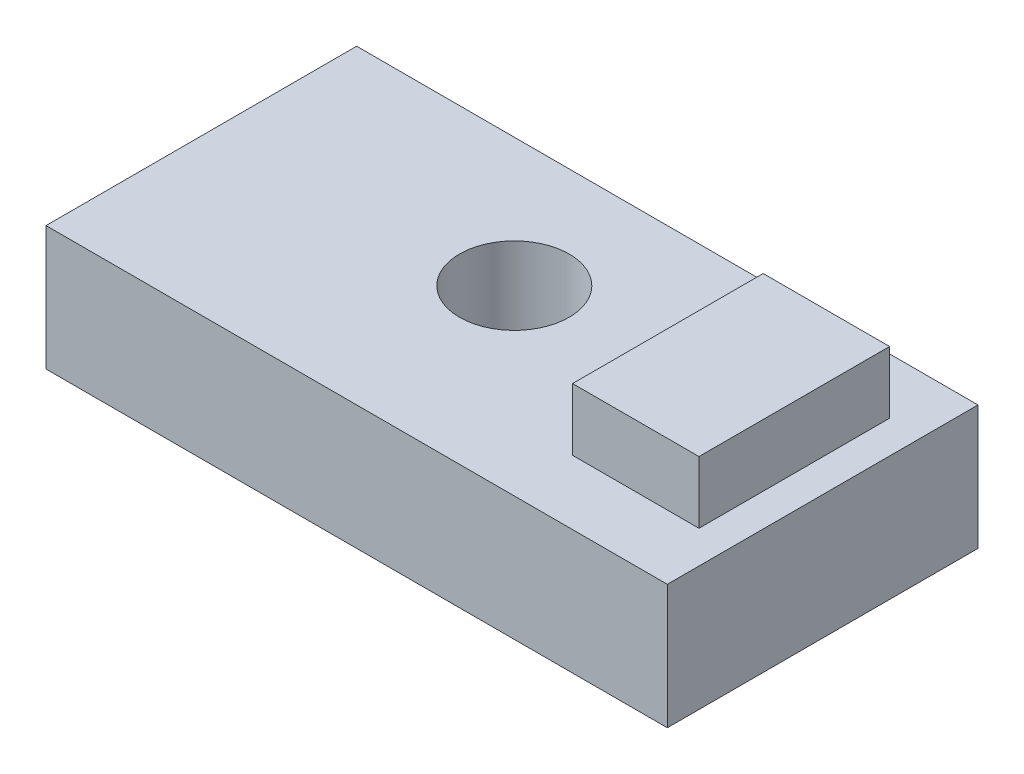
ISO-10303-21;
HEADER;
FILE_DESCRIPTION(('STEP AP214'),'2;1');
FILE_NAME('part.step','',(''),(''),'','','');
FILE_SCHEMA(('AUTOMOTIVE_DESIGN { 1 0 10303 214 1 1 1 1 }'));
ENDSEC;
DATA;
#1=APPLICATION_CONTEXT('core data for automotive mechanical design processes');
#2=APPLICATION_PROTOCOL_DEFINITION('international standard','automotive_design',2000,#1);
#3=PRODUCT_CONTEXT('',#1,'mechanical');
#4=PRODUCT('Part','Part','',(#3));
#5=PRODUCT_RELATED_PRODUCT_CATEGORY('part','',(#4));
#6=PRODUCT_DEFINITION_FORMATION('','',#4);
#7=PRODUCT_DEFINITION_CONTEXT('part definition',#1,'design');
#8=PRODUCT_DEFINITION('design','',#6,#7);
#9=PRODUCT_DEFINITION_SHAPE('','',#8);
#10=(LENGTH_UNIT() NAMED_UNIT(*) SI_UNIT(.MILLI.,.METRE.));
#11=(NAMED_UNIT(*) PLANE_ANGLE_UNIT() SI_UNIT($,.RADIAN.));
#12=(NAMED_UNIT(*) SI_UNIT($,.STERADIAN.) SOLID_ANGLE_UNIT());
#13=UNCERTAINTY_MEASURE_WITH_UNIT(LENGTH_MEASURE(1.E-05),#10,'distance_accuracy_value','');
#14=(GEOMETRIC_REPRESENTATION_CONTEXT(3) GLOBAL_UNCERTAINTY_ASSIGNED_CONTEXT((#13)) GLOBAL_UNIT_ASSIGNED_CONTEXT((#10,
#11,#12)) REPRESENTATION_CONTEXT('',''));
#15=CARTESIAN_POINT('',(0.,0.,0.));
#16=DIRECTION('',(0.,0.,1.));
#17=DIRECTION('',(1.,0.,0.));
#18=AXIS2_PLACEMENT_3D('',#15,#16,#17);
#19=CARTESIAN_POINT('',(0.,762.,0.));
#20=DIRECTION('',(0.,-1.,0.));
#21=DIRECTION('',(0.,0.,-1.));
#22=AXIS2_PLACEMENT_3D('',#19,#20,#21);
#23=PLANE('',#22);
#24=DIRECTION('',(1.,0.,0.));
#25=VECTOR('',#24,1.);
#26=CARTESIAN_POINT('',(-342.373271889401,762.,776.923963133641));
#27=LINE('',#26,#25);
#28=CARTESIAN_POINT('',(-342.373271889401,762.,776.923963133641));
#29=VERTEX_POINT('',#28);
#30=CARTESIAN_POINT('',(3467.6267281106,762.,776.923963133641));
#31=VERTEX_POINT('',#30);
#32=EDGE_CURVE('E145',#29,#31,#27,.T.);
#33=ORIENTED_EDGE('',*,*,#32,.T.);
#34=DIRECTION('',(0.,0.,1.));
#35=VECTOR('',#34,1.);
#36=CARTESIAN_POINT('',(3467.6267281106,762.,-1128.07603686636));
#37=LINE('',#36,#35);
#38=CARTESIAN_POINT('',(3467.6267281106,762.,-1128.07603686636));
#39=VERTEX_POINT('',#38);
#40=EDGE_CURVE('E148',#39,#31,#37,.T.);
#41=ORIENTED_EDGE('',*,*,#40,.F.);
#42=DIRECTION('',(1.,0.,0.));
#43=VECTOR('',#42,1.);
#44=CARTESIAN_POINT('',(-342.373271889401,762.,-1128.07603686636));
#45=LINE('',#44,#43);
#46=CARTESIAN_POINT('',(-342.373271889401,762.,-1128.07603686636));
#47=VERTEX_POINT('',#46);
#48=EDGE_CURVE('E153',#47,#39,#45,.T.);
#49=ORIENTED_EDGE('',*,*,#48,.F.);
#50=DIRECTION('',(0.,0.,1.));
#51=VECTOR('',#50,1.);
#52=CARTESIAN_POINT('',(-342.373271889401,762.,-1128.07603686636));
#53=LINE('',#52,#51);
#54=EDGE_CURVE('E157',#47,#29,#53,.T.);
#55=ORIENTED_EDGE('',*,*,#54,.T.);
#56=EDGE_LOOP('',(#33,#41,#49,#55));
#57=FACE_BOUND('',#56,.T.);
#58=CARTESIAN_POINT('',(1412.46673219988,762.,-339.940416014676));
#59=DIRECTION('',(0.,1.,0.));
#60=DIRECTION('',(0.,0.,1.));
#61=AXIS2_PLACEMENT_3D('',#58,#59,#60);
#62=CIRCLE('',#61,336.258211587935);
#63=CARTESIAN_POINT('',(1412.46673219988,762.,-3.68220442674011));
#64=VERTEX_POINT('',#63);
#65=EDGE_CURVE('E130',#64,#64,#62,.T.);
#66=ORIENTED_EDGE('',*,*,#65,.F.);
#67=EDGE_LOOP('',(#66));
#68=FACE_BOUND('',#67,.T.);
#69=DIRECTION('',(0.,0.,1.));
#70=VECTOR('',#69,1.);
#71=CARTESIAN_POINT('',(2491.99555228911,762.,-786.362098171456));
#72=LINE('',#71,#70);
#73=CARTESIAN_POINT('',(2491.99555228911,762.,-786.362098171456));
#74=VERTEX_POINT('',#73);
#75=CARTESIAN_POINT('',(2491.99555228911,762.,382.451095555233));
#76=VERTEX_POINT('',#75);
#77=EDGE_CURVE('E128',#74,#76,#72,.T.);
#78=ORIENTED_EDGE('',*,*,#77,.F.);
#79=DIRECTION('',(-1.,0.,0.));
#80=VECTOR('',#79,1.);
#81=CARTESIAN_POINT('',(2491.99555228911,762.,-786.362098171456));
#82=LINE('',#81,#80);
#83=CARTESIAN_POINT('',(3267.14596896202,762.,-786.362098171456));
#84=VERTEX_POINT('',#83);
#85=EDGE_CURVE('E125',#84,#74,#82,.T.);
#86=ORIENTED_EDGE('',*,*,#85,.F.);
#87=DIRECTION('',(0.,0.,-1.));
#88=VECTOR('',#87,1.);
#89=CARTESIAN_POINT('',(3267.14596896202,762.,-786.362098171456));
#90=LINE('',#89,#88);
#91=CARTESIAN_POINT('',(3267.14596896202,762.,382.451095555233));
#92=VERTEX_POINT('',#91);
#93=EDGE_CURVE('E62',#92,#84,#90,.T.);
#94=ORIENTED_EDGE('',*,*,#93,.F.);
#95=DIRECTION('',(1.,0.,0.));
#96=VECTOR('',#95,1.);
#97=CARTESIAN_POINT('',(2491.99555228911,762.,382.451095555233));
#98=LINE('',#97,#96);
#99=EDGE_CURVE('E57',#76,#92,#98,.T.);
#100=ORIENTED_EDGE('',*,*,#99,.F.);
#101=EDGE_LOOP('',(#78,#86,#94,#100));
#102=FACE_BOUND('',#101,.T.);
#103=ADVANCED_FACE('F41',(#57,#68,#102),#23,.F.);
#104=CARTESIAN_POINT('',(-342.373271889401,762.,776.923963133641));
#105=DIRECTION('',(0.,0.,-1.));
#106=DIRECTION('',(-1.,0.,0.));
#107=AXIS2_PLACEMENT_3D('',#104,#105,#106);
#108=PLANE('',#107);
#109=DIRECTION('',(1.,0.,0.));
#110=VECTOR('',#109,1.);
#111=CARTESIAN_POINT('',(-342.373271889401,0.,776.923963133641));
#112=LINE('',#111,#110);
#113=CARTESIAN_POINT('',(-342.373271889401,0.,776.923963133641));
#114=VERTEX_POINT('',#113);
#115=CARTESIAN_POINT('',(3467.6267281106,0.,776.923963133641));
#116=VERTEX_POINT('',#115);
#117=EDGE_CURVE('E143',#114,#116,#112,.T.);
#118=ORIENTED_EDGE('',*,*,#117,.T.);
#119=DIRECTION('',(0.,-1.,0.));
#120=VECTOR('',#119,1.);
#121=CARTESIAN_POINT('',(3467.6267281106,762.,776.923963133641));
#122=LINE('',#121,#120);
#123=EDGE_CURVE('E11',#31,#116,#122,.T.);
#124=ORIENTED_EDGE('',*,*,#123,.F.);
#125=ORIENTED_EDGE('',*,*,#32,.F.);
#126=DIRECTION('',(0.,-1.,0.));
#127=VECTOR('',#126,1.);
#128=CARTESIAN_POINT('',(-342.373271889401,762.,776.923963133641));
#129=LINE('',#128,#127);
#130=EDGE_CURVE('E160',#29,#114,#129,.T.);
#131=ORIENTED_EDGE('',*,*,#130,.T.);
#132=EDGE_LOOP('',(#118,#124,#125,#131));
#133=FACE_BOUND('',#132,.T.);
#134=ADVANCED_FACE('F43',(#133),#108,.F.);
#135=CARTESIAN_POINT('',(3467.6267281106,762.,-1128.07603686636));
#136=DIRECTION('',(1.,0.,0.));
#137=DIRECTION('',(0.,0.,-1.));
#138=AXIS2_PLACEMENT_3D('',#135,#136,#137);
#139=PLANE('',#138);
#140=DIRECTION('',(0.,0.,1.));
#141=VECTOR('',#140,1.);
#142=CARTESIAN_POINT('',(3467.6267281106,0.,-1128.07603686636));
#143=LINE('',#142,#141);
#144=CARTESIAN_POINT('',(3467.6267281106,0.,-1128.07603686636));
#145=VERTEX_POINT('',#144);
#146=EDGE_CURVE('E164',#145,#116,#143,.T.);
#147=ORIENTED_EDGE('',*,*,#146,.F.);
#148=DIRECTION('',(0.,-1.,0.));
#149=VECTOR('',#148,1.);
#150=CARTESIAN_POINT('',(3467.6267281106,762.,-1128.07603686636));
#151=LINE('',#150,#149);
#152=EDGE_CURVE('E50',#39,#145,#151,.T.);
#153=ORIENTED_EDGE('',*,*,#152,.F.);
#154=ORIENTED_EDGE('',*,*,#40,.T.);
#155=ORIENTED_EDGE('',*,*,#123,.T.);
#156=EDGE_LOOP('',(#147,#153,#154,#155));
#157=FACE_BOUND('',#156,.T.);
#158=ADVANCED_FACE('F187',(#157),#139,.T.);
#159=CARTESIAN_POINT('',(-342.373271889401,762.,-1128.07603686636));
#160=DIRECTION('',(0.,0.,-1.));
#161=DIRECTION('',(-1.,0.,0.));
#162=AXIS2_PLACEMENT_3D('',#159,#160,#161);
#163=PLANE('',#162);
#164=DIRECTION('',(1.,0.,0.));
#165=VECTOR('',#164,1.);
#166=CARTESIAN_POINT('',(-342.373271889401,0.,-1128.07603686636));
#167=LINE('',#166,#165);
#168=CARTESIAN_POINT('',(-342.373271889401,0.,-1128.07603686636));
#169=VERTEX_POINT('',#168);
#170=EDGE_CURVE('E168',#169,#145,#167,.T.);
#171=ORIENTED_EDGE('',*,*,#170,.F.);
#172=DIRECTION('',(0.,-1.,0.));
#173=VECTOR('',#172,1.);
#174=CARTESIAN_POINT('',(-342.373271889401,762.,-1128.07603686636));
#175=LINE('',#174,#173);
#176=EDGE_CURVE('E177',#47,#169,#175,.T.);
#177=ORIENTED_EDGE('',*,*,#176,.F.);
#178=ORIENTED_EDGE('',*,*,#48,.T.);
#179=ORIENTED_EDGE('',*,*,#152,.T.);
#180=EDGE_LOOP('',(#171,#177,#178,#179));
#181=FACE_BOUND('',#180,.T.);
#182=ADVANCED_FACE('F183',(#181),#163,.T.);
#183=CARTESIAN_POINT('',(-342.373271889401,762.,-1128.07603686636));
#184=DIRECTION('',(1.,0.,0.));
#185=DIRECTION('',(0.,0.,-1.));
#186=AXIS2_PLACEMENT_3D('',#183,#184,#185);
#187=PLANE('',#186);
#188=DIRECTION('',(0.,0.,1.));
#189=VECTOR('',#188,1.);
#190=CARTESIAN_POINT('',(-342.373271889401,0.,-1128.07603686636));
#191=LINE('',#190,#189);
#192=EDGE_CURVE('E149',#169,#114,#191,.T.);
#193=ORIENTED_EDGE('',*,*,#192,.T.);
#194=ORIENTED_EDGE('',*,*,#130,.F.);
#195=ORIENTED_EDGE('',*,*,#54,.F.);
#196=ORIENTED_EDGE('',*,*,#176,.T.);
#197=EDGE_LOOP('',(#193,#194,#195,#196));
#198=FACE_BOUND('',#197,.T.);
#199=ADVANCED_FACE('F195',(#198),#187,.F.);
#200=CARTESIAN_POINT('',(0.,0.,0.));
#201=DIRECTION('',(0.,-1.,0.));
#202=DIRECTION('',(0.,0.,-1.));
#203=AXIS2_PLACEMENT_3D('',#200,#201,#202);
#204=PLANE('',#203);
#205=CARTESIAN_POINT('',(1412.46673219988,0.,-339.940416014676));
#206=DIRECTION('',(0.,1.,0.));
#207=DIRECTION('',(0.,0.,1.));
#208=AXIS2_PLACEMENT_3D('',#205,#206,#207);
#209=CIRCLE('',#208,336.258211587935);
#210=CARTESIAN_POINT('',(1412.46673219988,0.,-3.68220442674011));
#211=VERTEX_POINT('',#210);
#212=EDGE_CURVE('E135',#211,#211,#209,.T.);
#213=ORIENTED_EDGE('',*,*,#212,.T.);
#214=EDGE_LOOP('',(#213));
#215=FACE_BOUND('',#214,.T.);
#216=ORIENTED_EDGE('',*,*,#117,.F.);
#217=ORIENTED_EDGE('',*,*,#192,.F.);
#218=ORIENTED_EDGE('',*,*,#170,.T.);
#219=ORIENTED_EDGE('',*,*,#146,.T.);
#220=EDGE_LOOP('',(#216,#217,#218,#219));
#221=FACE_BOUND('',#220,.T.);
#222=ADVANCED_FACE('F192',(#215,#221),#204,.T.);
#223=CARTESIAN_POINT('',(1412.46673219988,0.,-339.940416014676));
#224=DIRECTION('',(0.,1.,0.));
#225=DIRECTION('',(0.,0.,1.));
#226=AXIS2_PLACEMENT_3D('',#223,#224,#225);
#227=CYLINDRICAL_SURFACE('',#226,336.258211587935);
#228=ORIENTED_EDGE('',*,*,#212,.F.);
#229=EDGE_LOOP('',(#228));
#230=FACE_BOUND('',#229,.T.);
#231=ORIENTED_EDGE('',*,*,#65,.T.);
#232=EDGE_LOOP('',(#231));
#233=FACE_BOUND('',#232,.T.);
#234=ADVANCED_FACE('F239',(#230,#233),#227,.F.);
#235=CARTESIAN_POINT('',(2491.99555228911,1143.,-786.362098171456));
#236=DIRECTION('',(1.,0.,0.));
#237=DIRECTION('',(0.,0.,-1.));
#238=AXIS2_PLACEMENT_3D('',#235,#236,#237);
#239=PLANE('',#238);
#240=ORIENTED_EDGE('',*,*,#77,.T.);
#241=DIRECTION('',(0.,-1.,0.));
#242=VECTOR('',#241,1.);
#243=CARTESIAN_POINT('',(2491.99555228911,1143.,382.451095555233));
#244=LINE('',#243,#242);
#245=CARTESIAN_POINT('',(2491.99555228911,1143.,382.451095555233));
#246=VERTEX_POINT('',#245);
#247=EDGE_CURVE('E107',#246,#76,#244,.T.);
#248=ORIENTED_EDGE('',*,*,#247,.F.);
#249=DIRECTION('',(0.,0.,1.));
#250=VECTOR('',#249,1.);
#251=CARTESIAN_POINT('',(2491.99555228911,1143.,-786.362098171456));
#252=LINE('',#251,#250);
#253=CARTESIAN_POINT('',(2491.99555228911,1143.,-786.362098171456));
#254=VERTEX_POINT('',#253);
#255=EDGE_CURVE('E115',#254,#246,#252,.T.);
#256=ORIENTED_EDGE('',*,*,#255,.F.);
#257=DIRECTION('',(0.,-1.,0.));
#258=VECTOR('',#257,1.);
#259=CARTESIAN_POINT('',(2491.99555228911,1143.,-786.362098171456));
#260=LINE('',#259,#258);
#261=EDGE_CURVE('E210',#254,#74,#260,.T.);
#262=ORIENTED_EDGE('',*,*,#261,.T.);
#263=EDGE_LOOP('',(#240,#248,#256,#262));
#264=FACE_BOUND('',#263,.T.);
#265=ADVANCED_FACE('F127',(#264),#239,.F.);
#266=CARTESIAN_POINT('',(2491.99555228911,1143.,382.451095555233));
#267=DIRECTION('',(0.,0.,-1.));
#268=DIRECTION('',(-1.,0.,0.));
#269=AXIS2_PLACEMENT_3D('',#266,#267,#268);
#270=PLANE('',#269);
#271=ORIENTED_EDGE('',*,*,#99,.T.);
#272=DIRECTION('',(0.,-1.,0.));
#273=VECTOR('',#272,1.);
#274=CARTESIAN_POINT('',(3267.14596896202,1143.,382.451095555233));
#275=LINE('',#274,#273);
#276=CARTESIAN_POINT('',(3267.14596896202,1143.,382.451095555233));
#277=VERTEX_POINT('',#276);
#278=EDGE_CURVE('E110',#277,#92,#275,.T.);
#279=ORIENTED_EDGE('',*,*,#278,.F.);
#280=DIRECTION('',(1.,0.,0.));
#281=VECTOR('',#280,1.);
#282=CARTESIAN_POINT('',(2491.99555228911,1143.,382.451095555233));
#283=LINE('',#282,#281);
#284=EDGE_CURVE('E103',#246,#277,#283,.T.);
#285=ORIENTED_EDGE('',*,*,#284,.F.);
#286=ORIENTED_EDGE('',*,*,#247,.T.);
#287=EDGE_LOOP('',(#271,#279,#285,#286));
#288=FACE_BOUND('',#287,.T.);
#289=ADVANCED_FACE('F105',(#288),#270,.F.);
#290=CARTESIAN_POINT('',(3267.14596896202,1143.,-786.362098171456));
#291=DIRECTION('',(-1.,0.,0.));
#292=DIRECTION('',(0.,0.,1.));
#293=AXIS2_PLACEMENT_3D('',#290,#291,#292);
#294=PLANE('',#293);
#295=ORIENTED_EDGE('',*,*,#93,.T.);
#296=DIRECTION('',(0.,-1.,0.));
#297=VECTOR('',#296,1.);
#298=CARTESIAN_POINT('',(3267.14596896202,1143.,-786.362098171456));
#299=LINE('',#298,#297);
#300=CARTESIAN_POINT('',(3267.14596896202,1143.,-786.362098171456));
#301=VERTEX_POINT('',#300);
#302=EDGE_CURVE('E137',#301,#84,#299,.T.);
#303=ORIENTED_EDGE('',*,*,#302,.F.);
#304=DIRECTION('',(0.,0.,-1.));
#305=VECTOR('',#304,1.);
#306=CARTESIAN_POINT('',(3267.14596896202,1143.,-786.362098171456));
#307=LINE('',#306,#305);
#308=EDGE_CURVE('E114',#277,#301,#307,.T.);
#309=ORIENTED_EDGE('',*,*,#308,.F.);
#310=ORIENTED_EDGE('',*,*,#278,.T.);
#311=EDGE_LOOP('',(#295,#303,#309,#310));
#312=FACE_BOUND('',#311,.T.);
#313=ADVANCED_FACE('F226',(#312),#294,.F.);
#314=CARTESIAN_POINT('',(2491.99555228911,1143.,-786.362098171456));
#315=DIRECTION('',(0.,0.,1.));
#316=DIRECTION('',(1.,0.,0.));
#317=AXIS2_PLACEMENT_3D('',#314,#315,#316);
#318=PLANE('',#317);
#319=ORIENTED_EDGE('',*,*,#85,.T.);
#320=ORIENTED_EDGE('',*,*,#261,.F.);
#321=DIRECTION('',(-1.,0.,0.));
#322=VECTOR('',#321,1.);
#323=CARTESIAN_POINT('',(2491.99555228911,1143.,-786.362098171456));
#324=LINE('',#323,#322);
#325=EDGE_CURVE('E120',#301,#254,#324,.T.);
#326=ORIENTED_EDGE('',*,*,#325,.F.);
#327=ORIENTED_EDGE('',*,*,#302,.T.);
#328=EDGE_LOOP('',(#319,#320,#326,#327));
#329=FACE_BOUND('',#328,.T.);
#330=ADVANCED_FACE('F209',(#329),#318,.F.);
#331=CARTESIAN_POINT('',(0.,1143.,0.));
#332=DIRECTION('',(0.,1.,0.));
#333=DIRECTION('',(0.,0.,1.));
#334=AXIS2_PLACEMENT_3D('',#331,#332,#333);
#335=PLANE('',#334);
#336=ORIENTED_EDGE('',*,*,#255,.T.);
#337=ORIENTED_EDGE('',*,*,#284,.T.);
#338=ORIENTED_EDGE('',*,*,#308,.T.);
#339=ORIENTED_EDGE('',*,*,#325,.T.);
#340=EDGE_LOOP('',(#336,#337,#338,#339));
#341=FACE_BOUND('',#340,.T.);
#342=ADVANCED_FACE('F118',(#341),#335,.T.);
#343=CLOSED_SHELL('',(#103,#134,#158,#182,#199,#222,#234,#265,#289,#313,#330,#342));
#344=MANIFOLD_SOLID_BREP('B2',#343);
#345=ADVANCED_BREP_SHAPE_REPRESENTATION('',(#18,#344),#14);
#346=SHAPE_DEFINITION_REPRESENTATION(#9,#345);
ENDSEC;
END-ISO-10303-21;
